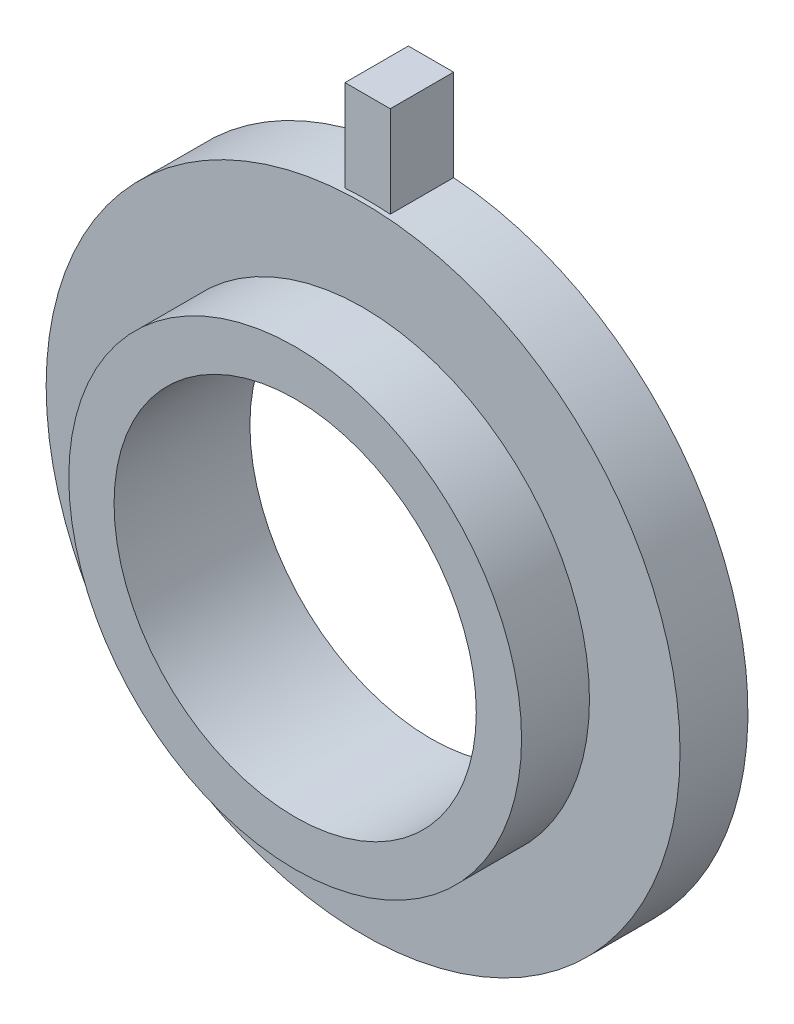
ISO-10303-21;
HEADER;
FILE_DESCRIPTION(('STEP AP214'),'2;1');
FILE_NAME('part.step','',(''),(''),'','','');
FILE_SCHEMA(('AUTOMOTIVE_DESIGN { 1 0 10303 214 1 1 1 1 }'));
ENDSEC;
DATA;
#1=APPLICATION_CONTEXT('core data for automotive mechanical design processes');
#2=APPLICATION_PROTOCOL_DEFINITION('international standard','automotive_design',2000,#1);
#3=PRODUCT_CONTEXT('',#1,'mechanical');
#4=PRODUCT('Part','Part','',(#3));
#5=PRODUCT_RELATED_PRODUCT_CATEGORY('part','',(#4));
#6=PRODUCT_DEFINITION_FORMATION('','',#4);
#7=PRODUCT_DEFINITION_CONTEXT('part definition',#1,'design');
#8=PRODUCT_DEFINITION('design','',#6,#7);
#9=PRODUCT_DEFINITION_SHAPE('','',#8);
#10=(LENGTH_UNIT() NAMED_UNIT(*) SI_UNIT(.MILLI.,.METRE.));
#11=(NAMED_UNIT(*) PLANE_ANGLE_UNIT() SI_UNIT($,.RADIAN.));
#12=(NAMED_UNIT(*) SI_UNIT($,.STERADIAN.) SOLID_ANGLE_UNIT());
#13=UNCERTAINTY_MEASURE_WITH_UNIT(LENGTH_MEASURE(1.E-05),#10,'distance_accuracy_value','');
#14=(GEOMETRIC_REPRESENTATION_CONTEXT(3) GLOBAL_UNCERTAINTY_ASSIGNED_CONTEXT((#13)) GLOBAL_UNIT_ASSIGNED_CONTEXT((#10,
#11,#12)) REPRESENTATION_CONTEXT('',''));
#15=CARTESIAN_POINT('',(0.,0.,0.));
#16=DIRECTION('',(0.,0.,1.));
#17=DIRECTION('',(1.,0.,0.));
#18=AXIS2_PLACEMENT_3D('',#15,#16,#17);
#19=CARTESIAN_POINT('',(0.,0.,7.5));
#20=DIRECTION('',(0.,0.,-1.));
#21=DIRECTION('',(-1.,0.,0.));
#22=AXIS2_PLACEMENT_3D('',#19,#20,#21);
#23=CYLINDRICAL_SURFACE('',#22,35.);
#24=CARTESIAN_POINT('',(0.,0.,7.5));
#25=DIRECTION('',(0.,0.,-1.));
#26=DIRECTION('',(-1.,0.,0.));
#27=AXIS2_PLACEMENT_3D('',#24,#25,#26);
#28=CIRCLE('',#27,35.);
#29=CARTESIAN_POINT('',(-35.,0.,7.5));
#30=VERTEX_POINT('',#29);
#31=EDGE_CURVE('E99',#30,#30,#28,.T.);
#32=ORIENTED_EDGE('',*,*,#31,.T.);
#33=EDGE_LOOP('',(#32));
#34=FACE_BOUND('',#33,.T.);
#35=CARTESIAN_POINT('',(0.,0.,0.));
#36=DIRECTION('',(0.,0.,-1.));
#37=DIRECTION('',(-1.,0.,0.));
#38=AXIS2_PLACEMENT_3D('',#35,#36,#37);
#39=CIRCLE('',#38,35.);
#40=CARTESIAN_POINT('',(2.5,34.9106001094224,0.));
#41=VERTEX_POINT('',#40);
#42=CARTESIAN_POINT('',(-2.5,34.9106001094224,0.));
#43=VERTEX_POINT('',#42);
#44=EDGE_CURVE('E97',#41,#43,#39,.T.);
#45=ORIENTED_EDGE('',*,*,#44,.F.);
#46=DIRECTION('',(0.,0.,-1.));
#47=VECTOR('',#46,1.);
#48=CARTESIAN_POINT('',(2.5,34.9106001094224,7.5));
#49=LINE('',#48,#47);
#50=CARTESIAN_POINT('',(2.5,34.9106001094224,7.));
#51=VERTEX_POINT('',#50);
#52=EDGE_CURVE('E11',#41,#51,#49,.F.);
#53=ORIENTED_EDGE('',*,*,#52,.T.);
#54=CARTESIAN_POINT('',(0.,0.,7.));
#55=DIRECTION('',(0.,0.,-1.));
#56=DIRECTION('',(-1.,0.,0.));
#57=AXIS2_PLACEMENT_3D('',#54,#55,#56);
#58=CIRCLE('',#57,35.);
#59=CARTESIAN_POINT('',(-2.5,34.9106001094224,7.));
#60=VERTEX_POINT('',#59);
#61=EDGE_CURVE('E83',#51,#60,#58,.F.);
#62=ORIENTED_EDGE('',*,*,#61,.T.);
#63=DIRECTION('',(0.,0.,-1.));
#64=VECTOR('',#63,1.);
#65=CARTESIAN_POINT('',(-2.5,34.9106001094224,7.5));
#66=LINE('',#65,#64);
#67=EDGE_CURVE('E44',#60,#43,#66,.T.);
#68=ORIENTED_EDGE('',*,*,#67,.T.);
#69=EDGE_LOOP('',(#45,#53,#62,#68));
#70=FACE_BOUND('',#69,.T.);
#71=ADVANCED_FACE('F36',(#34,#70),#23,.T.);
#72=CARTESIAN_POINT('',(0.,0.,15.));
#73=DIRECTION('',(0.,0.,-1.));
#74=DIRECTION('',(-1.,0.,0.));
#75=AXIS2_PLACEMENT_3D('',#72,#73,#74);
#76=CYLINDRICAL_SURFACE('',#75,25.);
#77=CARTESIAN_POINT('',(0.,0.,15.));
#78=DIRECTION('',(0.,0.,1.));
#79=DIRECTION('',(1.,0.,0.));
#80=AXIS2_PLACEMENT_3D('',#77,#78,#79);
#81=CIRCLE('',#80,25.);
#82=CARTESIAN_POINT('',(25.,0.,15.));
#83=VERTEX_POINT('',#82);
#84=EDGE_CURVE('E110',#83,#83,#81,.T.);
#85=ORIENTED_EDGE('',*,*,#84,.F.);
#86=EDGE_LOOP('',(#85));
#87=FACE_BOUND('',#86,.T.);
#88=CARTESIAN_POINT('',(0.,0.,7.5));
#89=DIRECTION('',(0.,0.,-1.));
#90=DIRECTION('',(-1.,0.,0.));
#91=AXIS2_PLACEMENT_3D('',#88,#89,#90);
#92=CIRCLE('',#91,25.);
#93=CARTESIAN_POINT('',(-25.,0.,7.5));
#94=VERTEX_POINT('',#93);
#95=EDGE_CURVE('E115',#94,#94,#92,.T.);
#96=ORIENTED_EDGE('',*,*,#95,.F.);
#97=EDGE_LOOP('',(#96));
#98=FACE_BOUND('',#97,.T.);
#99=ADVANCED_FACE('F38',(#87,#98),#76,.T.);
#100=CARTESIAN_POINT('',(0.,0.,15.));
#101=DIRECTION('',(0.,0.,1.));
#102=DIRECTION('',(1.,0.,0.));
#103=AXIS2_PLACEMENT_3D('',#100,#101,#102);
#104=PLANE('',#103);
#105=ORIENTED_EDGE('',*,*,#84,.T.);
#106=EDGE_LOOP('',(#105));
#107=FACE_BOUND('',#106,.T.);
#108=CARTESIAN_POINT('',(0.,0.,15.));
#109=DIRECTION('',(0.,0.,1.));
#110=DIRECTION('',(1.,0.,0.));
#111=AXIS2_PLACEMENT_3D('',#108,#109,#110);
#112=CIRCLE('',#111,20.);
#113=CARTESIAN_POINT('',(20.,0.,15.));
#114=VERTEX_POINT('',#113);
#115=EDGE_CURVE('E107',#114,#114,#112,.T.);
#116=ORIENTED_EDGE('',*,*,#115,.F.);
#117=EDGE_LOOP('',(#116));
#118=FACE_BOUND('',#117,.T.);
#119=ADVANCED_FACE('F142',(#107,#118),#104,.T.);
#120=CARTESIAN_POINT('',(0.,0.,0.));
#121=DIRECTION('',(0.,0.,1.));
#122=DIRECTION('',(1.,0.,0.));
#123=AXIS2_PLACEMENT_3D('',#120,#121,#122);
#124=PLANE('',#123);
#125=ORIENTED_EDGE('',*,*,#44,.T.);
#126=DIRECTION('',(0.,-1.,0.));
#127=VECTOR('',#126,1.);
#128=CARTESIAN_POINT('',(-2.5,45.,0.));
#129=LINE('',#128,#127);
#130=CARTESIAN_POINT('',(-2.5,45.,0.));
#131=VERTEX_POINT('',#130);
#132=EDGE_CURVE('E86',#131,#43,#129,.T.);
#133=ORIENTED_EDGE('',*,*,#132,.F.);
#134=DIRECTION('',(-1.,0.,0.));
#135=VECTOR('',#134,1.);
#136=CARTESIAN_POINT('',(2.5,45.,0.));
#137=LINE('',#136,#135);
#138=CARTESIAN_POINT('',(2.5,45.,0.));
#139=VERTEX_POINT('',#138);
#140=EDGE_CURVE('E123',#139,#131,#137,.T.);
#141=ORIENTED_EDGE('',*,*,#140,.F.);
#142=DIRECTION('',(0.,1.,0.));
#143=VECTOR('',#142,1.);
#144=CARTESIAN_POINT('',(2.5,45.,0.));
#145=LINE('',#144,#143);
#146=EDGE_CURVE('E51',#41,#139,#145,.T.);
#147=ORIENTED_EDGE('',*,*,#146,.F.);
#148=EDGE_LOOP('',(#125,#133,#141,#147));
#149=FACE_BOUND('',#148,.T.);
#150=CARTESIAN_POINT('',(0.,0.,0.));
#151=DIRECTION('',(0.,0.,1.));
#152=DIRECTION('',(1.,0.,0.));
#153=AXIS2_PLACEMENT_3D('',#150,#151,#152);
#154=CIRCLE('',#153,20.);
#155=CARTESIAN_POINT('',(20.,0.,0.));
#156=VERTEX_POINT('',#155);
#157=EDGE_CURVE('E105',#156,#156,#154,.T.);
#158=ORIENTED_EDGE('',*,*,#157,.T.);
#159=EDGE_LOOP('',(#158));
#160=FACE_BOUND('',#159,.T.);
#161=ADVANCED_FACE('F121',(#149,#160),#124,.F.);
#162=CARTESIAN_POINT('',(0.,0.,15.));
#163=DIRECTION('',(0.,0.,-1.));
#164=DIRECTION('',(-1.,0.,0.));
#165=AXIS2_PLACEMENT_3D('',#162,#163,#164);
#166=CYLINDRICAL_SURFACE('',#165,20.);
#167=ORIENTED_EDGE('',*,*,#115,.T.);
#168=EDGE_LOOP('',(#167));
#169=FACE_BOUND('',#168,.T.);
#170=ORIENTED_EDGE('',*,*,#157,.F.);
#171=EDGE_LOOP('',(#170));
#172=FACE_BOUND('',#171,.T.);
#173=ADVANCED_FACE('F148',(#169,#172),#166,.F.);
#174=CARTESIAN_POINT('',(0.,0.,7.5));
#175=DIRECTION('',(0.,0.,-1.));
#176=DIRECTION('',(-1.,0.,0.));
#177=AXIS2_PLACEMENT_3D('',#174,#175,#176);
#178=PLANE('',#177);
#179=ORIENTED_EDGE('',*,*,#95,.T.);
#180=EDGE_LOOP('',(#179));
#181=FACE_BOUND('',#180,.T.);
#182=ORIENTED_EDGE('',*,*,#31,.F.);
#183=EDGE_LOOP('',(#182));
#184=FACE_BOUND('',#183,.T.);
#185=ADVANCED_FACE('F146',(#181,#184),#178,.F.);
#186=CARTESIAN_POINT('',(2.5,45.,7.));
#187=DIRECTION('',(-1.,0.,0.));
#188=DIRECTION('',(0.,-1.,0.));
#189=AXIS2_PLACEMENT_3D('',#186,#187,#188);
#190=PLANE('',#189);
#191=ORIENTED_EDGE('',*,*,#52,.F.);
#192=ORIENTED_EDGE('',*,*,#146,.T.);
#193=DIRECTION('',(0.,0.,-1.));
#194=VECTOR('',#193,1.);
#195=CARTESIAN_POINT('',(2.5,45.,7.));
#196=LINE('',#195,#194);
#197=CARTESIAN_POINT('',(2.5,45.,7.));
#198=VERTEX_POINT('',#197);
#199=EDGE_CURVE('E91',#198,#139,#196,.T.);
#200=ORIENTED_EDGE('',*,*,#199,.F.);
#201=DIRECTION('',(0.,1.,0.));
#202=VECTOR('',#201,1.);
#203=CARTESIAN_POINT('',(2.5,45.,7.));
#204=LINE('',#203,#202);
#205=EDGE_CURVE('E77',#51,#198,#204,.T.);
#206=ORIENTED_EDGE('',*,*,#205,.F.);
#207=EDGE_LOOP('',(#191,#192,#200,#206));
#208=FACE_BOUND('',#207,.T.);
#209=ADVANCED_FACE('F96',(#208),#190,.F.);
#210=CARTESIAN_POINT('',(2.5,45.,7.));
#211=DIRECTION('',(0.,-1.,0.));
#212=DIRECTION('',(0.,0.,-1.));
#213=AXIS2_PLACEMENT_3D('',#210,#211,#212);
#214=PLANE('',#213);
#215=ORIENTED_EDGE('',*,*,#140,.T.);
#216=DIRECTION('',(0.,0.,-1.));
#217=VECTOR('',#216,1.);
#218=CARTESIAN_POINT('',(-2.5,45.,7.));
#219=LINE('',#218,#217);
#220=CARTESIAN_POINT('',(-2.5,45.,7.));
#221=VERTEX_POINT('',#220);
#222=EDGE_CURVE('E93',#221,#131,#219,.T.);
#223=ORIENTED_EDGE('',*,*,#222,.F.);
#224=DIRECTION('',(-1.,0.,0.));
#225=VECTOR('',#224,1.);
#226=CARTESIAN_POINT('',(2.5,45.,7.));
#227=LINE('',#226,#225);
#228=EDGE_CURVE('E80',#198,#221,#227,.T.);
#229=ORIENTED_EDGE('',*,*,#228,.F.);
#230=ORIENTED_EDGE('',*,*,#199,.T.);
#231=EDGE_LOOP('',(#215,#223,#229,#230));
#232=FACE_BOUND('',#231,.T.);
#233=ADVANCED_FACE('F90',(#232),#214,.F.);
#234=CARTESIAN_POINT('',(-2.5,45.,7.));
#235=DIRECTION('',(1.,0.,0.));
#236=DIRECTION('',(0.,1.,0.));
#237=AXIS2_PLACEMENT_3D('',#234,#235,#236);
#238=PLANE('',#237);
#239=ORIENTED_EDGE('',*,*,#67,.F.);
#240=DIRECTION('',(0.,-1.,0.));
#241=VECTOR('',#240,1.);
#242=CARTESIAN_POINT('',(-2.5,45.,7.));
#243=LINE('',#242,#241);
#244=EDGE_CURVE('E94',#221,#60,#243,.T.);
#245=ORIENTED_EDGE('',*,*,#244,.F.);
#246=ORIENTED_EDGE('',*,*,#222,.T.);
#247=ORIENTED_EDGE('',*,*,#132,.T.);
#248=EDGE_LOOP('',(#239,#245,#246,#247));
#249=FACE_BOUND('',#248,.T.);
#250=ADVANCED_FACE('F127',(#249),#238,.F.);
#251=CARTESIAN_POINT('',(0.,0.,7.));
#252=DIRECTION('',(0.,0.,-1.));
#253=DIRECTION('',(-1.,0.,0.));
#254=AXIS2_PLACEMENT_3D('',#251,#252,#253);
#255=PLANE('',#254);
#256=ORIENTED_EDGE('',*,*,#61,.F.);
#257=ORIENTED_EDGE('',*,*,#205,.T.);
#258=ORIENTED_EDGE('',*,*,#228,.T.);
#259=ORIENTED_EDGE('',*,*,#244,.T.);
#260=EDGE_LOOP('',(#256,#257,#258,#259));
#261=FACE_BOUND('',#260,.T.);
#262=ADVANCED_FACE('F79',(#261),#255,.F.);
#263=CLOSED_SHELL('',(#71,#99,#119,#161,#173,#185,#209,#233,#250,#262));
#264=MANIFOLD_SOLID_BREP('B2',#263);
#265=ADVANCED_BREP_SHAPE_REPRESENTATION('',(#18,#264),#14);
#266=SHAPE_DEFINITION_REPRESENTATION(#9,#265);
ENDSEC;
END-ISO-10303-21;
